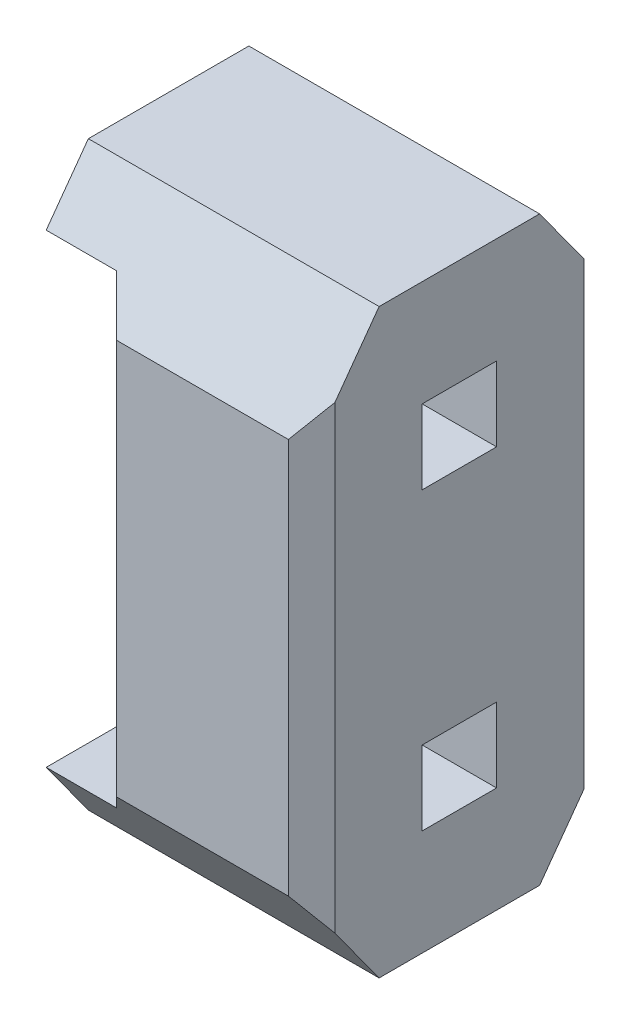
ISO-10303-21;
HEADER;
FILE_DESCRIPTION(('STEP AP214'),'2;1');
FILE_NAME('part.step','',(''),(''),'','','');
FILE_SCHEMA(('AUTOMOTIVE_DESIGN { 1 0 10303 214 1 1 1 1 }'));
ENDSEC;
DATA;
#1=APPLICATION_CONTEXT('core data for automotive mechanical design processes');
#2=APPLICATION_PROTOCOL_DEFINITION('international standard','automotive_design',2000,#1);
#3=PRODUCT_CONTEXT('',#1,'mechanical');
#4=PRODUCT('Part','Part','',(#3));
#5=PRODUCT_RELATED_PRODUCT_CATEGORY('part','',(#4));
#6=PRODUCT_DEFINITION_FORMATION('','',#4);
#7=PRODUCT_DEFINITION_CONTEXT('part definition',#1,'design');
#8=PRODUCT_DEFINITION('design','',#6,#7);
#9=PRODUCT_DEFINITION_SHAPE('','',#8);
#10=(LENGTH_UNIT() NAMED_UNIT(*) SI_UNIT(.MILLI.,.METRE.));
#11=(NAMED_UNIT(*) PLANE_ANGLE_UNIT() SI_UNIT($,.RADIAN.));
#12=(NAMED_UNIT(*) SI_UNIT($,.STERADIAN.) SOLID_ANGLE_UNIT());
#13=UNCERTAINTY_MEASURE_WITH_UNIT(LENGTH_MEASURE(1.E-05),#10,'distance_accuracy_value','');
#14=(GEOMETRIC_REPRESENTATION_CONTEXT(3) GLOBAL_UNCERTAINTY_ASSIGNED_CONTEXT((#13)) GLOBAL_UNIT_ASSIGNED_CONTEXT((#10,
#11,#12)) REPRESENTATION_CONTEXT('',''));
#15=CARTESIAN_POINT('',(0.,0.,0.));
#16=DIRECTION('',(0.,0.,1.));
#17=DIRECTION('',(1.,0.,0.));
#18=AXIS2_PLACEMENT_3D('',#15,#16,#17);
#19=CARTESIAN_POINT('',(1.25,4.6,-0.29));
#20=DIRECTION('',(0.,0.586967571460905,0.809610443394407));
#21=DIRECTION('',(0.,-0.809610443394407,0.586967571460905));
#22=AXIS2_PLACEMENT_3D('',#19,#20,#21);
#23=PLANE('',#22);
#24=DIRECTION('',(1.,0.,0.));
#25=VECTOR('',#24,1.);
#26=CARTESIAN_POINT('',(1.25,4.5,-0.217500000000003));
#27=LINE('',#26,#25);
#28=CARTESIAN_POINT('',(0.,4.5,-0.217500000000002));
#29=VERTEX_POINT('',#28);
#30=CARTESIAN_POINT('',(0.602500000000002,4.5,-0.217500000000004));
#31=VERTEX_POINT('',#30);
#32=EDGE_CURVE('E198',#29,#31,#27,.T.);
#33=ORIENTED_EDGE('',*,*,#32,.T.);
#34=DIRECTION('',(0.506207656349388,-0.698217457033654,0.506207656349365));
#35=VECTOR('',#34,1.);
#36=CARTESIAN_POINT('',(0.6025,4.5,-0.217500000000003));
#37=LINE('',#36,#35);
#38=CARTESIAN_POINT('',(0.819999999999998,4.2,0.));
#39=VERTEX_POINT('',#38);
#40=EDGE_CURVE('E196',#31,#39,#37,.T.);
#41=ORIENTED_EDGE('',*,*,#40,.T.);
#42=DIRECTION('',(1.,0.,0.));
#43=VECTOR('',#42,1.);
#44=CARTESIAN_POINT('',(1.25,4.19999999999999,0.));
#45=LINE('',#44,#43);
#46=CARTESIAN_POINT('',(2.29999999999996,4.2,0.));
#47=VERTEX_POINT('',#46);
#48=EDGE_CURVE('E19',#39,#47,#45,.T.);
#49=ORIENTED_EDGE('',*,*,#48,.T.);
#50=DIRECTION('',(0.506207656348986,0.698217457033846,-0.506207656349504));
#51=VECTOR('',#50,1.);
#52=CARTESIAN_POINT('',(2.3,4.20000000000001,0.));
#53=LINE('',#52,#51);
#54=CARTESIAN_POINT('',(2.50000000000002,4.4758620689659,-0.200000000000071));
#55=VERTEX_POINT('',#54);
#56=EDGE_CURVE('E180',#47,#55,#53,.T.);
#57=ORIENTED_EDGE('',*,*,#56,.T.);
#58=DIRECTION('',(0.,-0.809610443394407,0.586967571460905));
#59=VECTOR('',#58,1.);
#60=CARTESIAN_POINT('',(2.5,4.6,-0.29));
#61=LINE('',#60,#59);
#62=CARTESIAN_POINT('',(2.5,5.,-0.579999999999994));
#63=VERTEX_POINT('',#62);
#64=EDGE_CURVE('E187',#55,#63,#61,.F.);
#65=ORIENTED_EDGE('',*,*,#64,.T.);
#66=DIRECTION('',(1.,0.,0.));
#67=VECTOR('',#66,1.);
#68=CARTESIAN_POINT('',(1.25,5.,-0.58));
#69=LINE('',#68,#67);
#70=CARTESIAN_POINT('',(0.,5.,-0.579999999999994));
#71=VERTEX_POINT('',#70);
#72=EDGE_CURVE('E214',#71,#63,#69,.T.);
#73=ORIENTED_EDGE('',*,*,#72,.F.);
#74=DIRECTION('',(0.,-0.809610443394407,0.586967571460905));
#75=VECTOR('',#74,1.);
#76=CARTESIAN_POINT('',(0.,4.6,-0.29));
#77=LINE('',#76,#75);
#78=EDGE_CURVE('E206',#71,#29,#77,.T.);
#79=ORIENTED_EDGE('',*,*,#78,.T.);
#80=EDGE_LOOP('',(#33,#41,#49,#57,#65,#73,#79));
#81=FACE_BOUND('',#80,.T.);
#82=ADVANCED_FACE('F16',(#81),#23,.T.);
#83=CARTESIAN_POINT('',(1.25,4.6,-2.25));
#84=DIRECTION('',(0.,-0.586967571460905,0.809610443394407));
#85=DIRECTION('',(0.,-0.809610443394407,-0.586967571460905));
#86=AXIS2_PLACEMENT_3D('',#83,#84,#85);
#87=PLANE('',#86);
#88=DIRECTION('',(0.,-0.809610443394407,-0.586967571460905));
#89=VECTOR('',#88,1.);
#90=CARTESIAN_POINT('',(0.,4.6,-2.25));
#91=LINE('',#90,#89);
#92=CARTESIAN_POINT('',(0.,5.,-1.96000000000001));
#93=VERTEX_POINT('',#92);
#94=CARTESIAN_POINT('',(0.,4.5,-2.3225));
#95=VERTEX_POINT('',#94);
#96=EDGE_CURVE('E262',#93,#95,#91,.T.);
#97=ORIENTED_EDGE('',*,*,#96,.F.);
#98=DIRECTION('',(1.,0.,0.));
#99=VECTOR('',#98,1.);
#100=CARTESIAN_POINT('',(1.25,5.,-1.96));
#101=LINE('',#100,#99);
#102=CARTESIAN_POINT('',(2.5,5.,-1.96));
#103=VERTEX_POINT('',#102);
#104=EDGE_CURVE('E226',#103,#93,#101,.F.);
#105=ORIENTED_EDGE('',*,*,#104,.F.);
#106=DIRECTION('',(0.,-0.809610443394407,-0.586967571460905));
#107=VECTOR('',#106,1.);
#108=CARTESIAN_POINT('',(2.5,4.6,-2.25));
#109=LINE('',#108,#107);
#110=CARTESIAN_POINT('',(2.5,4.47586206896592,-2.33999999999988));
#111=VERTEX_POINT('',#110);
#112=EDGE_CURVE('E222',#111,#103,#109,.F.);
#113=ORIENTED_EDGE('',*,*,#112,.F.);
#114=DIRECTION('',(0.506207656348956,0.69821745703386,0.506207656349513));
#115=VECTOR('',#114,1.);
#116=CARTESIAN_POINT('',(2.3,4.19999999999999,-2.53999999999999));
#117=LINE('',#116,#115);
#118=CARTESIAN_POINT('',(2.3,4.2,-2.53999999999999));
#119=VERTEX_POINT('',#118);
#120=EDGE_CURVE('E265',#119,#111,#117,.T.);
#121=ORIENTED_EDGE('',*,*,#120,.F.);
#122=DIRECTION('',(1.,0.,0.));
#123=VECTOR('',#122,1.);
#124=CARTESIAN_POINT('',(1.25,4.19999999999999,-2.53999999999999));
#125=LINE('',#124,#123);
#126=CARTESIAN_POINT('',(0.819999999999963,4.2,-2.54000000000003));
#127=VERTEX_POINT('',#126);
#128=EDGE_CURVE('E204',#127,#119,#125,.T.);
#129=ORIENTED_EDGE('',*,*,#128,.F.);
#130=DIRECTION('',(0.506207656349388,-0.698217457033655,-0.506207656349365));
#131=VECTOR('',#130,1.);
#132=CARTESIAN_POINT('',(0.6025,4.5,-2.3225));
#133=LINE('',#132,#131);
#134=CARTESIAN_POINT('',(0.602500000000036,4.5,-2.32249999999996));
#135=VERTEX_POINT('',#134);
#136=EDGE_CURVE('E202',#135,#127,#133,.T.);
#137=ORIENTED_EDGE('',*,*,#136,.F.);
#138=DIRECTION('',(1.,0.,0.));
#139=VECTOR('',#138,1.);
#140=CARTESIAN_POINT('',(1.25,4.5,-2.3225));
#141=LINE('',#140,#139);
#142=EDGE_CURVE('E260',#95,#135,#141,.T.);
#143=ORIENTED_EDGE('',*,*,#142,.F.);
#144=EDGE_LOOP('',(#97,#105,#113,#121,#129,#137,#143));
#145=FACE_BOUND('',#144,.T.);
#146=ADVANCED_FACE('F284',(#145),#87,.F.);
#147=CARTESIAN_POINT('',(1.25,0.4,-2.25));
#148=DIRECTION('',(0.,0.586967571460905,0.809610443394407));
#149=DIRECTION('',(0.,-0.809610443394407,0.586967571460905));
#150=AXIS2_PLACEMENT_3D('',#147,#148,#149);
#151=PLANE('',#150);
#152=DIRECTION('',(-0.506207656349403,0.698217457033647,-0.506207656349359));
#153=VECTOR('',#152,1.);
#154=CARTESIAN_POINT('',(2.5,0.524137931034497,-2.34));
#155=LINE('',#154,#153);
#156=CARTESIAN_POINT('',(2.5,0.524137931034499,-2.34));
#157=VERTEX_POINT('',#156);
#158=CARTESIAN_POINT('',(2.3,0.800000000000005,-2.53999999999999));
#159=VERTEX_POINT('',#158);
#160=EDGE_CURVE('E250',#157,#159,#155,.T.);
#161=ORIENTED_EDGE('',*,*,#160,.F.);
#162=DIRECTION('',(0.,-0.809610443394407,0.586967571460905));
#163=VECTOR('',#162,1.);
#164=CARTESIAN_POINT('',(2.5,0.4,-2.25));
#165=LINE('',#164,#163);
#166=CARTESIAN_POINT('',(2.5,0.,-1.96));
#167=VERTEX_POINT('',#166);
#168=EDGE_CURVE('E252',#167,#157,#165,.F.);
#169=ORIENTED_EDGE('',*,*,#168,.F.);
#170=DIRECTION('',(1.,0.,0.));
#171=VECTOR('',#170,1.);
#172=CARTESIAN_POINT('',(1.25,0.,-1.96));
#173=LINE('',#172,#171);
#174=CARTESIAN_POINT('',(0.,0.,-1.96000000000001));
#175=VERTEX_POINT('',#174);
#176=EDGE_CURVE('E287',#167,#175,#173,.F.);
#177=ORIENTED_EDGE('',*,*,#176,.T.);
#178=DIRECTION('',(0.,-0.809610443394407,0.586967571460905));
#179=VECTOR('',#178,1.);
#180=CARTESIAN_POINT('',(0.,0.4,-2.25));
#181=LINE('',#180,#179);
#182=CARTESIAN_POINT('',(0.,0.500000000000001,-2.3225));
#183=VERTEX_POINT('',#182);
#184=EDGE_CURVE('E254',#183,#175,#181,.T.);
#185=ORIENTED_EDGE('',*,*,#184,.F.);
#186=DIRECTION('',(1.,0.,0.));
#187=VECTOR('',#186,1.);
#188=CARTESIAN_POINT('',(1.25,0.500000000000002,-2.3225));
#189=LINE('',#188,#187);
#190=CARTESIAN_POINT('',(0.602500000000036,0.500000000000001,-2.32249999999996));
#191=VERTEX_POINT('',#190);
#192=EDGE_CURVE('E256',#191,#183,#189,.F.);
#193=ORIENTED_EDGE('',*,*,#192,.F.);
#194=DIRECTION('',(-0.506207656349387,-0.698217457033655,0.506207656349365));
#195=VECTOR('',#194,1.);
#196=CARTESIAN_POINT('',(0.82,0.800000000000009,-2.53999999999999));
#197=LINE('',#196,#195);
#198=CARTESIAN_POINT('',(0.819999999999963,0.800000000000005,-2.54000000000003));
#199=VERTEX_POINT('',#198);
#200=EDGE_CURVE('E258',#199,#191,#197,.T.);
#201=ORIENTED_EDGE('',*,*,#200,.F.);
#202=DIRECTION('',(1.,0.,0.));
#203=VECTOR('',#202,1.);
#204=CARTESIAN_POINT('',(1.25,0.800000000000009,-2.53999999999999));
#205=LINE('',#204,#203);
#206=EDGE_CURVE('E248',#159,#199,#205,.F.);
#207=ORIENTED_EDGE('',*,*,#206,.F.);
#208=EDGE_LOOP('',(#161,#169,#177,#185,#193,#201,#207));
#209=FACE_BOUND('',#208,.T.);
#210=ADVANCED_FACE('F430',(#209),#151,.F.);
#211=CARTESIAN_POINT('',(1.25,0.4,-0.29));
#212=DIRECTION('',(0.,-0.586967571460905,0.809610443394407));
#213=DIRECTION('',(0.,-0.809610443394407,-0.586967571460905));
#214=AXIS2_PLACEMENT_3D('',#211,#212,#213);
#215=PLANE('',#214);
#216=DIRECTION('',(1.,0.,0.));
#217=VECTOR('',#216,1.);
#218=CARTESIAN_POINT('',(1.25,0.799999999999988,0.));
#219=LINE('',#218,#217);
#220=CARTESIAN_POINT('',(2.29999999999997,0.799999999999994,0.));
#221=VERTEX_POINT('',#220);
#222=CARTESIAN_POINT('',(0.81999999999999,0.799999999999994,0.));
#223=VERTEX_POINT('',#222);
#224=EDGE_CURVE('E190',#221,#223,#219,.F.);
#225=ORIENTED_EDGE('',*,*,#224,.T.);
#226=DIRECTION('',(-0.506207656349387,-0.698217457033655,-0.506207656349365));
#227=VECTOR('',#226,1.);
#228=CARTESIAN_POINT('',(0.82,0.80000000000001,0.));
#229=LINE('',#228,#227);
#230=CARTESIAN_POINT('',(0.602500000000002,0.500000000000001,-0.217500000000004));
#231=VERTEX_POINT('',#230);
#232=EDGE_CURVE('E231',#223,#231,#229,.T.);
#233=ORIENTED_EDGE('',*,*,#232,.T.);
#234=DIRECTION('',(1.,0.,0.));
#235=VECTOR('',#234,1.);
#236=CARTESIAN_POINT('',(1.25,0.500000000000002,-0.217500000000003));
#237=LINE('',#236,#235);
#238=CARTESIAN_POINT('',(0.,0.500000000000001,-0.217500000000002));
#239=VERTEX_POINT('',#238);
#240=EDGE_CURVE('E245',#231,#239,#237,.F.);
#241=ORIENTED_EDGE('',*,*,#240,.T.);
#242=DIRECTION('',(0.,-0.809610443394407,-0.586967571460905));
#243=VECTOR('',#242,1.);
#244=CARTESIAN_POINT('',(0.,0.4,-0.29));
#245=LINE('',#244,#243);
#246=CARTESIAN_POINT('',(0.,0.,-0.579999999999994));
#247=VERTEX_POINT('',#246);
#248=EDGE_CURVE('E243',#239,#247,#245,.T.);
#249=ORIENTED_EDGE('',*,*,#248,.T.);
#250=DIRECTION('',(1.,0.,0.));
#251=VECTOR('',#250,1.);
#252=CARTESIAN_POINT('',(1.25,0.,-0.58));
#253=LINE('',#252,#251);
#254=CARTESIAN_POINT('',(2.5,0.,-0.579999999999997));
#255=VERTEX_POINT('',#254);
#256=EDGE_CURVE('E292',#247,#255,#253,.T.);
#257=ORIENTED_EDGE('',*,*,#256,.T.);
#258=DIRECTION('',(0.,-0.809610443394407,-0.586967571460905));
#259=VECTOR('',#258,1.);
#260=CARTESIAN_POINT('',(2.5,0.4,-0.29));
#261=LINE('',#260,#259);
#262=CARTESIAN_POINT('',(2.50000000000002,0.524137931034488,-0.199999999999935));
#263=VERTEX_POINT('',#262);
#264=EDGE_CURVE('E240',#255,#263,#261,.F.);
#265=ORIENTED_EDGE('',*,*,#264,.T.);
#266=DIRECTION('',(-0.506207656349497,0.698217457033602,0.506207656349327));
#267=VECTOR('',#266,1.);
#268=CARTESIAN_POINT('',(2.5,0.524137931034545,-0.199999999999961));
#269=LINE('',#268,#267);
#270=EDGE_CURVE('E238',#263,#221,#269,.T.);
#271=ORIENTED_EDGE('',*,*,#270,.T.);
#272=EDGE_LOOP('',(#225,#233,#241,#249,#257,#265,#271));
#273=FACE_BOUND('',#272,.T.);
#274=ADVANCED_FACE('F420',(#273),#215,.T.);
#275=CARTESIAN_POINT('',(1.25,5.,-1.27));
#276=DIRECTION('',(0.,1.,0.));
#277=DIRECTION('',(0.,0.,1.));
#278=AXIS2_PLACEMENT_3D('',#275,#276,#277);
#279=PLANE('',#278);
#280=ORIENTED_EDGE('',*,*,#104,.T.);
#281=DIRECTION('',(0.,0.,-1.));
#282=VECTOR('',#281,1.);
#283=CARTESIAN_POINT('',(0.,5.,-1.27));
#284=LINE('',#283,#282);
#285=EDGE_CURVE('E230',#93,#71,#284,.F.);
#286=ORIENTED_EDGE('',*,*,#285,.T.);
#287=ORIENTED_EDGE('',*,*,#72,.T.);
#288=DIRECTION('',(0.,0.,1.));
#289=VECTOR('',#288,1.);
#290=CARTESIAN_POINT('',(2.5,5.,-1.27));
#291=LINE('',#290,#289);
#292=EDGE_CURVE('E218',#63,#103,#291,.F.);
#293=ORIENTED_EDGE('',*,*,#292,.T.);
#294=EDGE_LOOP('',(#280,#286,#287,#293));
#295=FACE_BOUND('',#294,.T.);
#296=ADVANCED_FACE('F228',(#295),#279,.T.);
#297=CARTESIAN_POINT('',(1.25,0.,-1.27));
#298=DIRECTION('',(0.,1.,0.));
#299=DIRECTION('',(0.,0.,1.));
#300=AXIS2_PLACEMENT_3D('',#297,#298,#299);
#301=PLANE('',#300);
#302=DIRECTION('',(0.,0.,-1.));
#303=VECTOR('',#302,1.);
#304=CARTESIAN_POINT('',(0.,0.,-1.27));
#305=LINE('',#304,#303);
#306=EDGE_CURVE('E296',#247,#175,#305,.T.);
#307=ORIENTED_EDGE('',*,*,#306,.T.);
#308=ORIENTED_EDGE('',*,*,#176,.F.);
#309=DIRECTION('',(0.,0.,1.));
#310=VECTOR('',#309,1.);
#311=CARTESIAN_POINT('',(2.5,0.,-1.27));
#312=LINE('',#311,#310);
#313=EDGE_CURVE('E286',#255,#167,#312,.F.);
#314=ORIENTED_EDGE('',*,*,#313,.F.);
#315=ORIENTED_EDGE('',*,*,#256,.F.);
#316=EDGE_LOOP('',(#307,#308,#314,#315));
#317=FACE_BOUND('',#316,.T.);
#318=ADVANCED_FACE('F427',(#317),#301,.F.);
#319=CARTESIAN_POINT('',(0.,4.75,-1.27));
#320=DIRECTION('',(1.,0.,0.));
#321=DIRECTION('',(0.,0.,-1.));
#322=AXIS2_PLACEMENT_3D('',#319,#320,#321);
#323=PLANE('',#322);
#324=ORIENTED_EDGE('',*,*,#285,.F.);
#325=ORIENTED_EDGE('',*,*,#96,.T.);
#326=DIRECTION('',(0.,0.,1.));
#327=VECTOR('',#326,1.);
#328=CARTESIAN_POINT('',(0.,4.5,-1.27));
#329=LINE('',#328,#327);
#330=EDGE_CURVE('E306',#95,#29,#329,.T.);
#331=ORIENTED_EDGE('',*,*,#330,.T.);
#332=ORIENTED_EDGE('',*,*,#78,.F.);
#333=EDGE_LOOP('',(#324,#325,#331,#332));
#334=FACE_BOUND('',#333,.T.);
#335=ADVANCED_FACE('F440',(#334),#323,.F.);
#336=CARTESIAN_POINT('',(0.,0.25,-1.27));
#337=DIRECTION('',(1.,0.,0.));
#338=DIRECTION('',(0.,0.,-1.));
#339=AXIS2_PLACEMENT_3D('',#336,#337,#338);
#340=PLANE('',#339);
#341=ORIENTED_EDGE('',*,*,#306,.F.);
#342=ORIENTED_EDGE('',*,*,#248,.F.);
#343=DIRECTION('',(0.,0.,1.));
#344=VECTOR('',#343,1.);
#345=CARTESIAN_POINT('',(0.,0.5,-1.27));
#346=LINE('',#345,#344);
#347=EDGE_CURVE('E314',#183,#239,#346,.T.);
#348=ORIENTED_EDGE('',*,*,#347,.F.);
#349=ORIENTED_EDGE('',*,*,#184,.T.);
#350=EDGE_LOOP('',(#341,#342,#348,#349));
#351=FACE_BOUND('',#350,.T.);
#352=ADVANCED_FACE('F442',(#351),#340,.F.);
#353=CARTESIAN_POINT('',(1.55,3.45,-1.27));
#354=DIRECTION('',(0.,1.,0.));
#355=DIRECTION('',(0.,0.,1.));
#356=AXIS2_PLACEMENT_3D('',#353,#354,#355);
#357=PLANE('',#356);
#358=DIRECTION('',(1.,0.,0.));
#359=VECTOR('',#358,1.);
#360=CARTESIAN_POINT('',(1.55,3.45,-1.59));
#361=LINE('',#360,#359);
#362=CARTESIAN_POINT('',(0.6,3.45,-1.59));
#363=VERTEX_POINT('',#362);
#364=CARTESIAN_POINT('',(2.5,3.45,-1.59));
#365=VERTEX_POINT('',#364);
#366=EDGE_CURVE('E331',#363,#365,#361,.T.);
#367=ORIENTED_EDGE('',*,*,#366,.F.);
#368=DIRECTION('',(0.,0.,1.));
#369=VECTOR('',#368,1.);
#370=CARTESIAN_POINT('',(0.6,3.45,-1.27));
#371=LINE('',#370,#369);
#372=CARTESIAN_POINT('',(0.6,3.45,-0.95));
#373=VERTEX_POINT('',#372);
#374=EDGE_CURVE('E301',#363,#373,#371,.T.);
#375=ORIENTED_EDGE('',*,*,#374,.T.);
#376=DIRECTION('',(1.,0.,0.));
#377=VECTOR('',#376,1.);
#378=CARTESIAN_POINT('',(1.55,3.45,-0.95));
#379=LINE('',#378,#377);
#380=CARTESIAN_POINT('',(2.5,3.45,-0.95));
#381=VERTEX_POINT('',#380);
#382=EDGE_CURVE('E326',#373,#381,#379,.T.);
#383=ORIENTED_EDGE('',*,*,#382,.T.);
#384=DIRECTION('',(0.,0.,1.));
#385=VECTOR('',#384,1.);
#386=CARTESIAN_POINT('',(2.5,3.45,-1.27));
#387=LINE('',#386,#385);
#388=EDGE_CURVE('E299',#381,#365,#387,.F.);
#389=ORIENTED_EDGE('',*,*,#388,.T.);
#390=EDGE_LOOP('',(#367,#375,#383,#389));
#391=FACE_BOUND('',#390,.T.);
#392=ADVANCED_FACE('F397',(#391),#357,.T.);
#393=CARTESIAN_POINT('',(0.71,2.5,-2.43));
#394=DIRECTION('',(0.707106781187498,0.,0.707106781185598));
#395=DIRECTION('',(0.707106781185598,0.,-0.707106781187498));
#396=AXIS2_PLACEMENT_3D('',#393,#394,#395);
#397=PLANE('',#396);
#398=ORIENTED_EDGE('',*,*,#200,.T.);
#399=DIRECTION('',(0.707106781186578,0.,-0.707106781186517));
#400=VECTOR('',#399,1.);
#401=CARTESIAN_POINT('',(0.6,0.5,-2.32));
#402=LINE('',#401,#400);
#403=CARTESIAN_POINT('',(0.600000000000074,0.5,-2.31999999999993));
#404=VERTEX_POINT('',#403);
#405=EDGE_CURVE('E311',#404,#191,#402,.T.);
#406=ORIENTED_EDGE('',*,*,#405,.F.);
#407=DIRECTION('',(0.,1.,0.));
#408=VECTOR('',#407,1.);
#409=CARTESIAN_POINT('',(0.6,2.5,-2.32));
#410=LINE('',#409,#408);
#411=CARTESIAN_POINT('',(0.600000000000074,4.5,-2.31999999999993));
#412=VERTEX_POINT('',#411);
#413=EDGE_CURVE('E336',#404,#412,#410,.T.);
#414=ORIENTED_EDGE('',*,*,#413,.T.);
#415=DIRECTION('',(0.707106781186578,0.,-0.707106781186517));
#416=VECTOR('',#415,1.);
#417=CARTESIAN_POINT('',(0.6,4.5,-2.32));
#418=LINE('',#417,#416);
#419=EDGE_CURVE('E303',#412,#135,#418,.T.);
#420=ORIENTED_EDGE('',*,*,#419,.T.);
#421=ORIENTED_EDGE('',*,*,#136,.T.);
#422=DIRECTION('',(0.,1.,0.));
#423=VECTOR('',#422,1.);
#424=CARTESIAN_POINT('',(0.82,2.5,-2.54));
#425=LINE('',#424,#423);
#426=EDGE_CURVE('E274',#127,#199,#425,.F.);
#427=ORIENTED_EDGE('',*,*,#426,.T.);
#428=EDGE_LOOP('',(#398,#406,#414,#420,#421,#427));
#429=FACE_BOUND('',#428,.T.);
#430=ADVANCED_FACE('F434',(#429),#397,.F.);
#431=CARTESIAN_POINT('',(0.30125,4.5,-1.27));
#432=DIRECTION('',(0.,1.,0.));
#433=DIRECTION('',(0.,0.,1.));
#434=AXIS2_PLACEMENT_3D('',#431,#432,#433);
#435=PLANE('',#434);
#436=ORIENTED_EDGE('',*,*,#142,.T.);
#437=ORIENTED_EDGE('',*,*,#419,.F.);
#438=DIRECTION('',(0.,0.,-1.));
#439=VECTOR('',#438,1.);
#440=CARTESIAN_POINT('',(0.6,4.5,-1.27));
#441=LINE('',#440,#439);
#442=CARTESIAN_POINT('',(0.600000000000002,4.5,-0.220000000000002));
#443=VERTEX_POINT('',#442);
#444=EDGE_CURVE('E338',#412,#443,#441,.F.);
#445=ORIENTED_EDGE('',*,*,#444,.T.);
#446=DIRECTION('',(-0.707106781186498,0.,-0.707106781186598));
#447=VECTOR('',#446,1.);
#448=CARTESIAN_POINT('',(0.71,4.5,-0.11));
#449=LINE('',#448,#447);
#450=EDGE_CURVE('E309',#443,#31,#449,.F.);
#451=ORIENTED_EDGE('',*,*,#450,.T.);
#452=ORIENTED_EDGE('',*,*,#32,.F.);
#453=ORIENTED_EDGE('',*,*,#330,.F.);
#454=EDGE_LOOP('',(#436,#437,#445,#451,#452,#453));
#455=FACE_BOUND('',#454,.T.);
#456=ADVANCED_FACE('F438',(#455),#435,.F.);
#457=CARTESIAN_POINT('',(0.71,2.5,-0.11));
#458=DIRECTION('',(0.707106781186598,0.,-0.707106781186498));
#459=DIRECTION('',(-0.707106781186498,0.,-0.707106781186598));
#460=AXIS2_PLACEMENT_3D('',#457,#458,#459);
#461=PLANE('',#460);
#462=ORIENTED_EDGE('',*,*,#232,.F.);
#463=DIRECTION('',(0.,1.,0.));
#464=VECTOR('',#463,1.);
#465=CARTESIAN_POINT('',(0.82,2.5,0.));
#466=LINE('',#465,#464);
#467=EDGE_CURVE('E324',#39,#223,#466,.F.);
#468=ORIENTED_EDGE('',*,*,#467,.F.);
#469=ORIENTED_EDGE('',*,*,#40,.F.);
#470=ORIENTED_EDGE('',*,*,#450,.F.);
#471=DIRECTION('',(0.,1.,0.));
#472=VECTOR('',#471,1.);
#473=CARTESIAN_POINT('',(0.6,2.5,-0.22));
#474=LINE('',#473,#472);
#475=CARTESIAN_POINT('',(0.600000000000004,0.5,-0.220000000000004));
#476=VERTEX_POINT('',#475);
#477=EDGE_CURVE('E340',#443,#476,#474,.F.);
#478=ORIENTED_EDGE('',*,*,#477,.T.);
#479=DIRECTION('',(-0.707106781186578,0.,-0.707106781186517));
#480=VECTOR('',#479,1.);
#481=CARTESIAN_POINT('',(0.6025,0.5,-0.2175));
#482=LINE('',#481,#480);
#483=EDGE_CURVE('E317',#231,#476,#482,.T.);
#484=ORIENTED_EDGE('',*,*,#483,.F.);
#485=EDGE_LOOP('',(#462,#468,#469,#470,#478,#484));
#486=FACE_BOUND('',#485,.T.);
#487=ADVANCED_FACE('F415',(#486),#461,.F.);
#488=CARTESIAN_POINT('',(0.30125,0.5,-1.27));
#489=DIRECTION('',(0.,1.,0.));
#490=DIRECTION('',(0.,0.,1.));
#491=AXIS2_PLACEMENT_3D('',#488,#489,#490);
#492=PLANE('',#491);
#493=ORIENTED_EDGE('',*,*,#483,.T.);
#494=DIRECTION('',(0.,0.,-1.));
#495=VECTOR('',#494,1.);
#496=CARTESIAN_POINT('',(0.6,0.5,-1.27));
#497=LINE('',#496,#495);
#498=EDGE_CURVE('E342',#476,#404,#497,.T.);
#499=ORIENTED_EDGE('',*,*,#498,.T.);
#500=ORIENTED_EDGE('',*,*,#405,.T.);
#501=ORIENTED_EDGE('',*,*,#192,.T.);
#502=ORIENTED_EDGE('',*,*,#347,.T.);
#503=ORIENTED_EDGE('',*,*,#240,.F.);
#504=EDGE_LOOP('',(#493,#499,#500,#501,#502,#503));
#505=FACE_BOUND('',#504,.T.);
#506=ADVANCED_FACE('F417',(#505),#492,.T.);
#507=CARTESIAN_POINT('',(1.55,1.23,-1.59));
#508=DIRECTION('',(0.,0.,1.));
#509=DIRECTION('',(1.,0.,0.));
#510=AXIS2_PLACEMENT_3D('',#507,#508,#509);
#511=PLANE('',#510);
#512=DIRECTION('',(1.,0.,0.));
#513=VECTOR('',#512,1.);
#514=CARTESIAN_POINT('',(1.55,1.55,-1.59));
#515=LINE('',#514,#513);
#516=CARTESIAN_POINT('',(2.5,1.55,-1.59));
#517=VERTEX_POINT('',#516);
#518=CARTESIAN_POINT('',(0.6,1.55,-1.59));
#519=VERTEX_POINT('',#518);
#520=EDGE_CURVE('E282',#517,#519,#515,.F.);
#521=ORIENTED_EDGE('',*,*,#520,.T.);
#522=DIRECTION('',(0.,1.,0.));
#523=VECTOR('',#522,1.);
#524=CARTESIAN_POINT('',(0.6,2.5,-1.59));
#525=LINE('',#524,#523);
#526=CARTESIAN_POINT('',(0.6,0.91,-1.59));
#527=VERTEX_POINT('',#526);
#528=EDGE_CURVE('E345',#519,#527,#525,.F.);
#529=ORIENTED_EDGE('',*,*,#528,.T.);
#530=DIRECTION('',(1.,0.,0.));
#531=VECTOR('',#530,1.);
#532=CARTESIAN_POINT('',(1.55,0.91,-1.59));
#533=LINE('',#532,#531);
#534=CARTESIAN_POINT('',(2.5,0.91,-1.59));
#535=VERTEX_POINT('',#534);
#536=EDGE_CURVE('E353',#535,#527,#533,.F.);
#537=ORIENTED_EDGE('',*,*,#536,.F.);
#538=DIRECTION('',(0.,1.,0.));
#539=VECTOR('',#538,1.);
#540=CARTESIAN_POINT('',(2.5,1.23,-1.59));
#541=LINE('',#540,#539);
#542=EDGE_CURVE('E320',#535,#517,#541,.T.);
#543=ORIENTED_EDGE('',*,*,#542,.T.);
#544=EDGE_LOOP('',(#521,#529,#537,#543));
#545=FACE_BOUND('',#544,.T.);
#546=ADVANCED_FACE('F482',(#545),#511,.T.);
#547=CARTESIAN_POINT('',(1.56,2.5,-2.54));
#548=DIRECTION('',(0.,0.,1.));
#549=DIRECTION('',(1.,0.,0.));
#550=AXIS2_PLACEMENT_3D('',#547,#548,#549);
#551=PLANE('',#550);
#552=DIRECTION('',(0.,1.,0.));
#553=VECTOR('',#552,1.);
#554=CARTESIAN_POINT('',(2.3,2.5,-2.54));
#555=LINE('',#554,#553);
#556=EDGE_CURVE('E192',#159,#119,#555,.T.);
#557=ORIENTED_EDGE('',*,*,#556,.F.);
#558=ORIENTED_EDGE('',*,*,#206,.T.);
#559=ORIENTED_EDGE('',*,*,#426,.F.);
#560=ORIENTED_EDGE('',*,*,#128,.T.);
#561=EDGE_LOOP('',(#557,#558,#559,#560));
#562=FACE_BOUND('',#561,.T.);
#563=ADVANCED_FACE('F271',(#562),#551,.F.);
#564=CARTESIAN_POINT('',(1.56,2.5,0.));
#565=DIRECTION('',(0.,0.,1.));
#566=DIRECTION('',(1.,0.,0.));
#567=AXIS2_PLACEMENT_3D('',#564,#565,#566);
#568=PLANE('',#567);
#569=ORIENTED_EDGE('',*,*,#48,.F.);
#570=ORIENTED_EDGE('',*,*,#467,.T.);
#571=ORIENTED_EDGE('',*,*,#224,.F.);
#572=DIRECTION('',(0.,1.,0.));
#573=VECTOR('',#572,1.);
#574=CARTESIAN_POINT('',(2.29999999999989,2.5,-1.56978922048745E-13));
#575=LINE('',#574,#573);
#576=EDGE_CURVE('E182',#47,#221,#575,.F.);
#577=ORIENTED_EDGE('',*,*,#576,.F.);
#578=EDGE_LOOP('',(#569,#570,#571,#577));
#579=FACE_BOUND('',#578,.T.);
#580=ADVANCED_FACE('F188',(#579),#568,.T.);
#581=CARTESIAN_POINT('',(1.55,3.77,-0.95));
#582=DIRECTION('',(0.,0.,1.));
#583=DIRECTION('',(1.,0.,0.));
#584=AXIS2_PLACEMENT_3D('',#581,#582,#583);
#585=PLANE('',#584);
#586=DIRECTION('',(0.,1.,0.));
#587=VECTOR('',#586,1.);
#588=CARTESIAN_POINT('',(2.5,3.77,-0.95));
#589=LINE('',#588,#587);
#590=CARTESIAN_POINT('',(2.5,4.09,-0.95));
#591=VERTEX_POINT('',#590);
#592=EDGE_CURVE('E329',#381,#591,#589,.T.);
#593=ORIENTED_EDGE('',*,*,#592,.F.);
#594=ORIENTED_EDGE('',*,*,#382,.F.);
#595=DIRECTION('',(0.,1.,0.));
#596=VECTOR('',#595,1.);
#597=CARTESIAN_POINT('',(0.6,2.5,-0.95));
#598=LINE('',#597,#596);
#599=CARTESIAN_POINT('',(0.6,4.09,-0.95));
#600=VERTEX_POINT('',#599);
#601=EDGE_CURVE('E350',#373,#600,#598,.T.);
#602=ORIENTED_EDGE('',*,*,#601,.T.);
#603=DIRECTION('',(1.,0.,0.));
#604=VECTOR('',#603,1.);
#605=CARTESIAN_POINT('',(1.55,4.09,-0.95));
#606=LINE('',#605,#604);
#607=EDGE_CURVE('E367',#600,#591,#606,.T.);
#608=ORIENTED_EDGE('',*,*,#607,.T.);
#609=EDGE_LOOP('',(#593,#594,#602,#608));
#610=FACE_BOUND('',#609,.T.);
#611=ADVANCED_FACE('F401',(#610),#585,.F.);
#612=CARTESIAN_POINT('',(1.55,3.77,-1.59));
#613=DIRECTION('',(0.,0.,1.));
#614=DIRECTION('',(1.,0.,0.));
#615=AXIS2_PLACEMENT_3D('',#612,#613,#614);
#616=PLANE('',#615);
#617=DIRECTION('',(1.,0.,0.));
#618=VECTOR('',#617,1.);
#619=CARTESIAN_POINT('',(1.55,4.09,-1.59));
#620=LINE('',#619,#618);
#621=CARTESIAN_POINT('',(2.5,4.09,-1.59));
#622=VERTEX_POINT('',#621);
#623=CARTESIAN_POINT('',(0.6,4.09,-1.59));
#624=VERTEX_POINT('',#623);
#625=EDGE_CURVE('E370',#622,#624,#620,.F.);
#626=ORIENTED_EDGE('',*,*,#625,.T.);
#627=DIRECTION('',(0.,1.,0.));
#628=VECTOR('',#627,1.);
#629=CARTESIAN_POINT('',(0.6,2.5,-1.59));
#630=LINE('',#629,#628);
#631=EDGE_CURVE('E347',#624,#363,#630,.F.);
#632=ORIENTED_EDGE('',*,*,#631,.T.);
#633=ORIENTED_EDGE('',*,*,#366,.T.);
#634=DIRECTION('',(0.,1.,0.));
#635=VECTOR('',#634,1.);
#636=CARTESIAN_POINT('',(2.5,3.77,-1.59));
#637=LINE('',#636,#635);
#638=EDGE_CURVE('E334',#365,#622,#637,.T.);
#639=ORIENTED_EDGE('',*,*,#638,.T.);
#640=EDGE_LOOP('',(#626,#632,#633,#639));
#641=FACE_BOUND('',#640,.T.);
#642=ADVANCED_FACE('F394',(#641),#616,.T.);
#643=CARTESIAN_POINT('',(0.6,2.5,-1.27));
#644=DIRECTION('',(1.,0.,0.));
#645=DIRECTION('',(0.,0.,-1.));
#646=AXIS2_PLACEMENT_3D('',#643,#644,#645);
#647=PLANE('',#646);
#648=ORIENTED_EDGE('',*,*,#374,.F.);
#649=ORIENTED_EDGE('',*,*,#631,.F.);
#650=DIRECTION('',(0.,0.,1.));
#651=VECTOR('',#650,1.);
#652=CARTESIAN_POINT('',(0.6,4.09,-1.27));
#653=LINE('',#652,#651);
#654=EDGE_CURVE('E191',#624,#600,#653,.T.);
#655=ORIENTED_EDGE('',*,*,#654,.T.);
#656=ORIENTED_EDGE('',*,*,#601,.F.);
#657=EDGE_LOOP('',(#648,#649,#655,#656));
#658=FACE_BOUND('',#657,.T.);
#659=ORIENTED_EDGE('',*,*,#528,.F.);
#660=DIRECTION('',(0.,0.,1.));
#661=VECTOR('',#660,1.);
#662=CARTESIAN_POINT('',(0.6,1.55,-1.27));
#663=LINE('',#662,#661);
#664=CARTESIAN_POINT('',(0.6,1.55,-0.95));
#665=VERTEX_POINT('',#664);
#666=EDGE_CURVE('E359',#519,#665,#663,.T.);
#667=ORIENTED_EDGE('',*,*,#666,.T.);
#668=DIRECTION('',(0.,1.,0.));
#669=VECTOR('',#668,1.);
#670=CARTESIAN_POINT('',(0.6,1.23,-0.95));
#671=LINE('',#670,#669);
#672=CARTESIAN_POINT('',(0.6,0.91,-0.95));
#673=VERTEX_POINT('',#672);
#674=EDGE_CURVE('E373',#665,#673,#671,.F.);
#675=ORIENTED_EDGE('',*,*,#674,.T.);
#676=DIRECTION('',(0.,0.,1.));
#677=VECTOR('',#676,1.);
#678=CARTESIAN_POINT('',(0.6,0.91,-1.27));
#679=LINE('',#678,#677);
#680=EDGE_CURVE('E356',#527,#673,#679,.T.);
#681=ORIENTED_EDGE('',*,*,#680,.F.);
#682=EDGE_LOOP('',(#659,#667,#675,#681));
#683=FACE_BOUND('',#682,.T.);
#684=ORIENTED_EDGE('',*,*,#477,.F.);
#685=ORIENTED_EDGE('',*,*,#444,.F.);
#686=ORIENTED_EDGE('',*,*,#413,.F.);
#687=ORIENTED_EDGE('',*,*,#498,.F.);
#688=EDGE_LOOP('',(#684,#685,#686,#687));
#689=FACE_BOUND('',#688,.T.);
#690=ADVANCED_FACE('F403',(#658,#683,#689),#647,.F.);
#691=CARTESIAN_POINT('',(1.55,0.91,-1.27));
#692=DIRECTION('',(0.,1.,0.));
#693=DIRECTION('',(0.,0.,1.));
#694=AXIS2_PLACEMENT_3D('',#691,#692,#693);
#695=PLANE('',#694);
#696=ORIENTED_EDGE('',*,*,#536,.T.);
#697=ORIENTED_EDGE('',*,*,#680,.T.);
#698=DIRECTION('',(1.,0.,0.));
#699=VECTOR('',#698,1.);
#700=CARTESIAN_POINT('',(1.55,0.91,-0.95));
#701=LINE('',#700,#699);
#702=CARTESIAN_POINT('',(2.5,0.91,-0.95));
#703=VERTEX_POINT('',#702);
#704=EDGE_CURVE('E375',#673,#703,#701,.T.);
#705=ORIENTED_EDGE('',*,*,#704,.T.);
#706=DIRECTION('',(0.,0.,1.));
#707=VECTOR('',#706,1.);
#708=CARTESIAN_POINT('',(2.5,0.91,-1.27));
#709=LINE('',#708,#707);
#710=EDGE_CURVE('E33',#703,#535,#709,.F.);
#711=ORIENTED_EDGE('',*,*,#710,.T.);
#712=EDGE_LOOP('',(#696,#697,#705,#711));
#713=FACE_BOUND('',#712,.T.);
#714=ADVANCED_FACE('F406',(#713),#695,.T.);
#715=CARTESIAN_POINT('',(1.55,1.55,-1.27));
#716=DIRECTION('',(0.,1.,0.));
#717=DIRECTION('',(0.,0.,1.));
#718=AXIS2_PLACEMENT_3D('',#715,#716,#717);
#719=PLANE('',#718);
#720=DIRECTION('',(0.,0.,1.));
#721=VECTOR('',#720,1.);
#722=CARTESIAN_POINT('',(2.5,1.55,-1.27));
#723=LINE('',#722,#721);
#724=CARTESIAN_POINT('',(2.5,1.55,-0.95));
#725=VERTEX_POINT('',#724);
#726=EDGE_CURVE('E361',#725,#517,#723,.F.);
#727=ORIENTED_EDGE('',*,*,#726,.F.);
#728=DIRECTION('',(1.,0.,0.));
#729=VECTOR('',#728,1.);
#730=CARTESIAN_POINT('',(1.55,1.55,-0.95));
#731=LINE('',#730,#729);
#732=EDGE_CURVE('E377',#725,#665,#731,.F.);
#733=ORIENTED_EDGE('',*,*,#732,.T.);
#734=ORIENTED_EDGE('',*,*,#666,.F.);
#735=ORIENTED_EDGE('',*,*,#520,.F.);
#736=EDGE_LOOP('',(#727,#733,#734,#735));
#737=FACE_BOUND('',#736,.T.);
#738=ADVANCED_FACE('F467',(#737),#719,.F.);
#739=CARTESIAN_POINT('',(2.4,2.5,-2.44));
#740=DIRECTION('',(0.707106781186548,0.,-0.707106781186548));
#741=DIRECTION('',(-0.707106781186548,0.,-0.707106781186548));
#742=AXIS2_PLACEMENT_3D('',#739,#740,#741);
#743=PLANE('',#742);
#744=DIRECTION('',(0.,1.,0.));
#745=VECTOR('',#744,1.);
#746=CARTESIAN_POINT('',(2.5,2.5,-2.34));
#747=LINE('',#746,#745);
#748=EDGE_CURVE('E380',#157,#111,#747,.T.);
#749=ORIENTED_EDGE('',*,*,#748,.F.);
#750=ORIENTED_EDGE('',*,*,#160,.T.);
#751=ORIENTED_EDGE('',*,*,#556,.T.);
#752=ORIENTED_EDGE('',*,*,#120,.T.);
#753=EDGE_LOOP('',(#749,#750,#751,#752));
#754=FACE_BOUND('',#753,.T.);
#755=ADVANCED_FACE('F280',(#754),#743,.T.);
#756=CARTESIAN_POINT('',(2.4,2.5,-0.1));
#757=DIRECTION('',(0.707106781185598,0.,0.707106781187498));
#758=DIRECTION('',(0.707106781187498,0.,-0.707106781185598));
#759=AXIS2_PLACEMENT_3D('',#756,#757,#758);
#760=PLANE('',#759);
#761=DIRECTION('',(0.,1.,0.));
#762=VECTOR('',#761,1.);
#763=CARTESIAN_POINT('',(2.5,2.5,-0.2));
#764=LINE('',#763,#762);
#765=EDGE_CURVE('E185',#55,#263,#764,.F.);
#766=ORIENTED_EDGE('',*,*,#765,.F.);
#767=ORIENTED_EDGE('',*,*,#56,.F.);
#768=ORIENTED_EDGE('',*,*,#576,.T.);
#769=ORIENTED_EDGE('',*,*,#270,.F.);
#770=EDGE_LOOP('',(#766,#767,#768,#769));
#771=FACE_BOUND('',#770,.T.);
#772=ADVANCED_FACE('F181',(#771),#760,.T.);
#773=CARTESIAN_POINT('',(1.55,4.09,-1.27));
#774=DIRECTION('',(0.,1.,0.));
#775=DIRECTION('',(0.,0.,1.));
#776=AXIS2_PLACEMENT_3D('',#773,#774,#775);
#777=PLANE('',#776);
#778=DIRECTION('',(0.,0.,-1.));
#779=VECTOR('',#778,1.);
#780=CARTESIAN_POINT('',(2.5,4.09,-1.27));
#781=LINE('',#780,#779);
#782=EDGE_CURVE('E25',#591,#622,#781,.T.);
#783=ORIENTED_EDGE('',*,*,#782,.F.);
#784=ORIENTED_EDGE('',*,*,#607,.F.);
#785=ORIENTED_EDGE('',*,*,#654,.F.);
#786=ORIENTED_EDGE('',*,*,#625,.F.);
#787=EDGE_LOOP('',(#783,#784,#785,#786));
#788=FACE_BOUND('',#787,.T.);
#789=ADVANCED_FACE('F391',(#788),#777,.F.);
#790=CARTESIAN_POINT('',(1.55,1.23,-0.95));
#791=DIRECTION('',(0.,0.,1.));
#792=DIRECTION('',(1.,0.,0.));
#793=AXIS2_PLACEMENT_3D('',#790,#791,#792);
#794=PLANE('',#793);
#795=DIRECTION('',(0.,1.,0.));
#796=VECTOR('',#795,1.);
#797=CARTESIAN_POINT('',(2.5,2.5,-0.95));
#798=LINE('',#797,#796);
#799=EDGE_CURVE('E10',#703,#725,#798,.T.);
#800=ORIENTED_EDGE('',*,*,#799,.F.);
#801=ORIENTED_EDGE('',*,*,#704,.F.);
#802=ORIENTED_EDGE('',*,*,#674,.F.);
#803=ORIENTED_EDGE('',*,*,#732,.F.);
#804=EDGE_LOOP('',(#800,#801,#802,#803));
#805=FACE_BOUND('',#804,.T.);
#806=ADVANCED_FACE('F453',(#805),#794,.F.);
#807=CARTESIAN_POINT('',(2.5,2.5,-1.27));
#808=DIRECTION('',(1.,0.,0.));
#809=DIRECTION('',(0.,0.,-1.));
#810=AXIS2_PLACEMENT_3D('',#807,#808,#809);
#811=PLANE('',#810);
#812=ORIENTED_EDGE('',*,*,#710,.F.);
#813=ORIENTED_EDGE('',*,*,#799,.T.);
#814=ORIENTED_EDGE('',*,*,#726,.T.);
#815=ORIENTED_EDGE('',*,*,#542,.F.);
#816=EDGE_LOOP('',(#812,#813,#814,#815));
#817=FACE_BOUND('',#816,.T.);
#818=ORIENTED_EDGE('',*,*,#592,.T.);
#819=ORIENTED_EDGE('',*,*,#782,.T.);
#820=ORIENTED_EDGE('',*,*,#638,.F.);
#821=ORIENTED_EDGE('',*,*,#388,.F.);
#822=EDGE_LOOP('',(#818,#819,#820,#821));
#823=FACE_BOUND('',#822,.T.);
#824=ORIENTED_EDGE('',*,*,#64,.F.);
#825=ORIENTED_EDGE('',*,*,#765,.T.);
#826=ORIENTED_EDGE('',*,*,#264,.F.);
#827=ORIENTED_EDGE('',*,*,#313,.T.);
#828=ORIENTED_EDGE('',*,*,#168,.T.);
#829=ORIENTED_EDGE('',*,*,#748,.T.);
#830=ORIENTED_EDGE('',*,*,#112,.T.);
#831=ORIENTED_EDGE('',*,*,#292,.F.);
#832=EDGE_LOOP('',(#824,#825,#826,#827,#828,#829,#830,#831));
#833=FACE_BOUND('',#832,.T.);
#834=ADVANCED_FACE('F219',(#817,#823,#833),#811,.T.);
#835=CLOSED_SHELL('',(#82,#146,#210,#274,#296,#318,#335,#352,#392,#430,#456,#487,#506,#546,#563,
#580,#611,#642,#690,#714,#738,#755,#772,#789,#806,#834));
#836=MANIFOLD_SOLID_BREP('B1',#835);
#837=ADVANCED_BREP_SHAPE_REPRESENTATION('',(#18,#836),#14);
#838=SHAPE_DEFINITION_REPRESENTATION(#9,#837);
ENDSEC;
END-ISO-10303-21;
